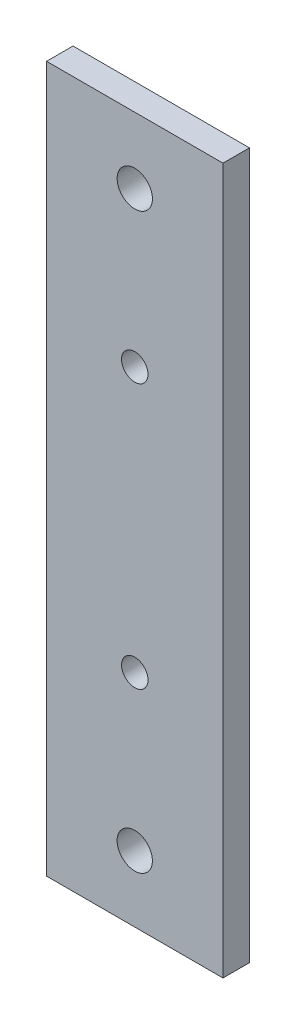
ISO-10303-21;
HEADER;
FILE_DESCRIPTION(('STEP AP214'),'2;1');
FILE_NAME('part.step','',(''),(''),'','','');
FILE_SCHEMA(('AUTOMOTIVE_DESIGN { 1 0 10303 214 1 1 1 1 }'));
ENDSEC;
DATA;
#1=APPLICATION_CONTEXT('core data for automotive mechanical design processes');
#2=APPLICATION_PROTOCOL_DEFINITION('international standard','automotive_design',2000,#1);
#3=PRODUCT_CONTEXT('',#1,'mechanical');
#4=PRODUCT('Part','Part','',(#3));
#5=PRODUCT_RELATED_PRODUCT_CATEGORY('part','',(#4));
#6=PRODUCT_DEFINITION_FORMATION('','',#4);
#7=PRODUCT_DEFINITION_CONTEXT('part definition',#1,'design');
#8=PRODUCT_DEFINITION('design','',#6,#7);
#9=PRODUCT_DEFINITION_SHAPE('','',#8);
#10=(LENGTH_UNIT() NAMED_UNIT(*) SI_UNIT(.MILLI.,.METRE.));
#11=(NAMED_UNIT(*) PLANE_ANGLE_UNIT() SI_UNIT($,.RADIAN.));
#12=(NAMED_UNIT(*) SI_UNIT($,.STERADIAN.) SOLID_ANGLE_UNIT());
#13=UNCERTAINTY_MEASURE_WITH_UNIT(LENGTH_MEASURE(1.E-05),#10,'distance_accuracy_value','');
#14=(GEOMETRIC_REPRESENTATION_CONTEXT(3) GLOBAL_UNCERTAINTY_ASSIGNED_CONTEXT((#13)) GLOBAL_UNIT_ASSIGNED_CONTEXT((#10,
#11,#12)) REPRESENTATION_CONTEXT('',''));
#15=CARTESIAN_POINT('',(0.,0.,0.));
#16=DIRECTION('',(0.,0.,1.));
#17=DIRECTION('',(1.,0.,0.));
#18=AXIS2_PLACEMENT_3D('',#15,#16,#17);
#19=CARTESIAN_POINT('',(0.,80.,3.));
#20=DIRECTION('',(0.,0.,-1.));
#21=DIRECTION('',(-1.,0.,0.));
#22=AXIS2_PLACEMENT_3D('',#19,#20,#21);
#23=PLANE('',#22);
#24=CARTESIAN_POINT('',(10.,72.5,3.));
#25=DIRECTION('',(0.,0.,1.));
#26=DIRECTION('',(1.,0.,0.));
#27=AXIS2_PLACEMENT_3D('',#24,#25,#26);
#28=CIRCLE('',#27,2.);
#29=CARTESIAN_POINT('',(12.,72.5,3.));
#30=VERTEX_POINT('',#29);
#31=EDGE_CURVE('E121',#30,#30,#28,.T.);
#32=ORIENTED_EDGE('',*,*,#31,.F.);
#33=EDGE_LOOP('',(#32));
#34=FACE_BOUND('',#33,.T.);
#35=CARTESIAN_POINT('',(10.,55.,3.));
#36=DIRECTION('',(0.,0.,1.));
#37=DIRECTION('',(1.,0.,0.));
#38=AXIS2_PLACEMENT_3D('',#35,#36,#37);
#39=CIRCLE('',#38,1.5);
#40=CARTESIAN_POINT('',(11.5,55.,3.));
#41=VERTEX_POINT('',#40);
#42=EDGE_CURVE('E100',#41,#41,#39,.T.);
#43=ORIENTED_EDGE('',*,*,#42,.F.);
#44=EDGE_LOOP('',(#43));
#45=FACE_BOUND('',#44,.T.);
#46=DIRECTION('',(0.,-1.,0.));
#47=VECTOR('',#46,1.);
#48=CARTESIAN_POINT('',(0.,0.,3.));
#49=LINE('',#48,#47);
#50=CARTESIAN_POINT('',(0.,80.,3.));
#51=VERTEX_POINT('',#50);
#52=CARTESIAN_POINT('',(0.,0.,3.));
#53=VERTEX_POINT('',#52);
#54=EDGE_CURVE('E85',#51,#53,#49,.T.);
#55=ORIENTED_EDGE('',*,*,#54,.T.);
#56=DIRECTION('',(1.,0.,0.));
#57=VECTOR('',#56,1.);
#58=CARTESIAN_POINT('',(0.,0.,3.));
#59=LINE('',#58,#57);
#60=CARTESIAN_POINT('',(20.,0.,3.));
#61=VERTEX_POINT('',#60);
#62=EDGE_CURVE('E80',#53,#61,#59,.T.);
#63=ORIENTED_EDGE('',*,*,#62,.T.);
#64=DIRECTION('',(0.,1.,0.));
#65=VECTOR('',#64,1.);
#66=CARTESIAN_POINT('',(20.,0.,3.));
#67=LINE('',#66,#65);
#68=CARTESIAN_POINT('',(20.,80.,3.));
#69=VERTEX_POINT('',#68);
#70=EDGE_CURVE('E83',#61,#69,#67,.T.);
#71=ORIENTED_EDGE('',*,*,#70,.T.);
#72=DIRECTION('',(-1.,0.,0.));
#73=VECTOR('',#72,1.);
#74=CARTESIAN_POINT('',(0.,80.,3.));
#75=LINE('',#74,#73);
#76=EDGE_CURVE('E50',#69,#51,#75,.T.);
#77=ORIENTED_EDGE('',*,*,#76,.T.);
#78=EDGE_LOOP('',(#55,#63,#71,#77));
#79=FACE_BOUND('',#78,.T.);
#80=CARTESIAN_POINT('',(10.,25.,3.));
#81=DIRECTION('',(0.,0.,1.));
#82=DIRECTION('',(-1.,0.,0.));
#83=AXIS2_PLACEMENT_3D('',#80,#81,#82);
#84=CIRCLE('',#83,1.5);
#85=CARTESIAN_POINT('',(8.5,25.,3.));
#86=VERTEX_POINT('',#85);
#87=EDGE_CURVE('E115',#86,#86,#84,.T.);
#88=ORIENTED_EDGE('',*,*,#87,.F.);
#89=EDGE_LOOP('',(#88));
#90=FACE_BOUND('',#89,.T.);
#91=CARTESIAN_POINT('',(10.,7.49999999999999,3.));
#92=DIRECTION('',(0.,0.,1.));
#93=DIRECTION('',(-1.,0.,0.));
#94=AXIS2_PLACEMENT_3D('',#91,#92,#93);
#95=CIRCLE('',#94,2.);
#96=CARTESIAN_POINT('',(8.,7.49999999999999,3.));
#97=VERTEX_POINT('',#96);
#98=EDGE_CURVE('E127',#97,#97,#95,.T.);
#99=ORIENTED_EDGE('',*,*,#98,.F.);
#100=EDGE_LOOP('',(#99));
#101=FACE_BOUND('',#100,.T.);
#102=ADVANCED_FACE('F33',(#34,#45,#79,#90,#101),#23,.F.);
#103=CARTESIAN_POINT('',(0.,80.,0.));
#104=DIRECTION('',(0.,0.,-1.));
#105=DIRECTION('',(-1.,0.,0.));
#106=AXIS2_PLACEMENT_3D('',#103,#104,#105);
#107=PLANE('',#106);
#108=CARTESIAN_POINT('',(10.,72.5,0.));
#109=DIRECTION('',(0.,0.,1.));
#110=DIRECTION('',(1.,0.,0.));
#111=AXIS2_PLACEMENT_3D('',#108,#109,#110);
#112=CIRCLE('',#111,2.);
#113=CARTESIAN_POINT('',(12.,72.5,0.));
#114=VERTEX_POINT('',#113);
#115=EDGE_CURVE('E124',#114,#114,#112,.T.);
#116=ORIENTED_EDGE('',*,*,#115,.T.);
#117=EDGE_LOOP('',(#116));
#118=FACE_BOUND('',#117,.T.);
#119=CARTESIAN_POINT('',(10.,55.,0.));
#120=DIRECTION('',(0.,0.,1.));
#121=DIRECTION('',(1.,0.,0.));
#122=AXIS2_PLACEMENT_3D('',#119,#120,#121);
#123=CIRCLE('',#122,1.5);
#124=CARTESIAN_POINT('',(11.5,55.,0.));
#125=VERTEX_POINT('',#124);
#126=EDGE_CURVE('E112',#125,#125,#123,.T.);
#127=ORIENTED_EDGE('',*,*,#126,.T.);
#128=EDGE_LOOP('',(#127));
#129=FACE_BOUND('',#128,.T.);
#130=DIRECTION('',(0.,-1.,0.));
#131=VECTOR('',#130,1.);
#132=CARTESIAN_POINT('',(0.,0.,0.));
#133=LINE('',#132,#131);
#134=CARTESIAN_POINT('',(0.,80.,0.));
#135=VERTEX_POINT('',#134);
#136=CARTESIAN_POINT('',(0.,0.,0.));
#137=VERTEX_POINT('',#136);
#138=EDGE_CURVE('E97',#135,#137,#133,.T.);
#139=ORIENTED_EDGE('',*,*,#138,.F.);
#140=DIRECTION('',(-1.,0.,0.));
#141=VECTOR('',#140,1.);
#142=CARTESIAN_POINT('',(0.,80.,0.));
#143=LINE('',#142,#141);
#144=CARTESIAN_POINT('',(20.,80.,0.));
#145=VERTEX_POINT('',#144);
#146=EDGE_CURVE('E73',#145,#135,#143,.T.);
#147=ORIENTED_EDGE('',*,*,#146,.F.);
#148=DIRECTION('',(0.,1.,0.));
#149=VECTOR('',#148,1.);
#150=CARTESIAN_POINT('',(20.,0.,0.));
#151=LINE('',#150,#149);
#152=CARTESIAN_POINT('',(20.,0.,0.));
#153=VERTEX_POINT('',#152);
#154=EDGE_CURVE('E67',#153,#145,#151,.T.);
#155=ORIENTED_EDGE('',*,*,#154,.F.);
#156=DIRECTION('',(1.,0.,0.));
#157=VECTOR('',#156,1.);
#158=CARTESIAN_POINT('',(0.,0.,0.));
#159=LINE('',#158,#157);
#160=EDGE_CURVE('E89',#137,#153,#159,.T.);
#161=ORIENTED_EDGE('',*,*,#160,.F.);
#162=EDGE_LOOP('',(#139,#147,#155,#161));
#163=FACE_BOUND('',#162,.T.);
#164=CARTESIAN_POINT('',(10.,25.,0.));
#165=DIRECTION('',(0.,0.,1.));
#166=DIRECTION('',(-1.,0.,0.));
#167=AXIS2_PLACEMENT_3D('',#164,#165,#166);
#168=CIRCLE('',#167,1.5);
#169=CARTESIAN_POINT('',(8.5,25.,0.));
#170=VERTEX_POINT('',#169);
#171=EDGE_CURVE('E118',#170,#170,#168,.T.);
#172=ORIENTED_EDGE('',*,*,#171,.T.);
#173=EDGE_LOOP('',(#172));
#174=FACE_BOUND('',#173,.T.);
#175=CARTESIAN_POINT('',(10.,7.49999999999999,0.));
#176=DIRECTION('',(0.,0.,1.));
#177=DIRECTION('',(-1.,0.,0.));
#178=AXIS2_PLACEMENT_3D('',#175,#176,#177);
#179=CIRCLE('',#178,2.);
#180=CARTESIAN_POINT('',(8.,7.49999999999999,0.));
#181=VERTEX_POINT('',#180);
#182=EDGE_CURVE('E130',#181,#181,#179,.T.);
#183=ORIENTED_EDGE('',*,*,#182,.T.);
#184=EDGE_LOOP('',(#183));
#185=FACE_BOUND('',#184,.T.);
#186=ADVANCED_FACE('F108',(#118,#129,#163,#174,#185),#107,.T.);
#187=CARTESIAN_POINT('',(0.,0.,3.));
#188=DIRECTION('',(1.,0.,0.));
#189=DIRECTION('',(0.,0.,-1.));
#190=AXIS2_PLACEMENT_3D('',#187,#188,#189);
#191=PLANE('',#190);
#192=ORIENTED_EDGE('',*,*,#138,.T.);
#193=DIRECTION('',(0.,0.,-1.));
#194=VECTOR('',#193,1.);
#195=CARTESIAN_POINT('',(0.,0.,3.));
#196=LINE('',#195,#194);
#197=EDGE_CURVE('E11',#53,#137,#196,.T.);
#198=ORIENTED_EDGE('',*,*,#197,.F.);
#199=ORIENTED_EDGE('',*,*,#54,.F.);
#200=DIRECTION('',(0.,0.,-1.));
#201=VECTOR('',#200,1.);
#202=CARTESIAN_POINT('',(0.,80.,3.));
#203=LINE('',#202,#201);
#204=EDGE_CURVE('E93',#51,#135,#203,.T.);
#205=ORIENTED_EDGE('',*,*,#204,.T.);
#206=EDGE_LOOP('',(#192,#198,#199,#205));
#207=FACE_BOUND('',#206,.T.);
#208=ADVANCED_FACE('F35',(#207),#191,.F.);
#209=CARTESIAN_POINT('',(0.,0.,3.));
#210=DIRECTION('',(0.,1.,0.));
#211=DIRECTION('',(0.,0.,1.));
#212=AXIS2_PLACEMENT_3D('',#209,#210,#211);
#213=PLANE('',#212);
#214=ORIENTED_EDGE('',*,*,#160,.T.);
#215=DIRECTION('',(0.,0.,-1.));
#216=VECTOR('',#215,1.);
#217=CARTESIAN_POINT('',(20.,0.,3.));
#218=LINE('',#217,#216);
#219=EDGE_CURVE('E42',#61,#153,#218,.T.);
#220=ORIENTED_EDGE('',*,*,#219,.F.);
#221=ORIENTED_EDGE('',*,*,#62,.F.);
#222=ORIENTED_EDGE('',*,*,#197,.T.);
#223=EDGE_LOOP('',(#214,#220,#221,#222));
#224=FACE_BOUND('',#223,.T.);
#225=ADVANCED_FACE('F88',(#224),#213,.F.);
#226=CARTESIAN_POINT('',(20.,0.,3.));
#227=DIRECTION('',(-1.,0.,0.));
#228=DIRECTION('',(0.,0.,1.));
#229=AXIS2_PLACEMENT_3D('',#226,#227,#228);
#230=PLANE('',#229);
#231=ORIENTED_EDGE('',*,*,#154,.T.);
#232=DIRECTION('',(0.,0.,-1.));
#233=VECTOR('',#232,1.);
#234=CARTESIAN_POINT('',(20.,80.,3.));
#235=LINE('',#234,#233);
#236=EDGE_CURVE('E90',#69,#145,#235,.T.);
#237=ORIENTED_EDGE('',*,*,#236,.F.);
#238=ORIENTED_EDGE('',*,*,#70,.F.);
#239=ORIENTED_EDGE('',*,*,#219,.T.);
#240=EDGE_LOOP('',(#231,#237,#238,#239));
#241=FACE_BOUND('',#240,.T.);
#242=ADVANCED_FACE('F91',(#241),#230,.F.);
#243=CARTESIAN_POINT('',(0.,80.,3.));
#244=DIRECTION('',(0.,-1.,0.));
#245=DIRECTION('',(0.,0.,-1.));
#246=AXIS2_PLACEMENT_3D('',#243,#244,#245);
#247=PLANE('',#246);
#248=ORIENTED_EDGE('',*,*,#146,.T.);
#249=ORIENTED_EDGE('',*,*,#204,.F.);
#250=ORIENTED_EDGE('',*,*,#76,.F.);
#251=ORIENTED_EDGE('',*,*,#236,.T.);
#252=EDGE_LOOP('',(#248,#249,#250,#251));
#253=FACE_BOUND('',#252,.T.);
#254=ADVANCED_FACE('F105',(#253),#247,.F.);
#255=CARTESIAN_POINT('',(10.,55.,3.));
#256=DIRECTION('',(0.,0.,-1.));
#257=DIRECTION('',(-1.,0.,0.));
#258=AXIS2_PLACEMENT_3D('',#255,#256,#257);
#259=CYLINDRICAL_SURFACE('',#258,1.5);
#260=ORIENTED_EDGE('',*,*,#42,.T.);
#261=EDGE_LOOP('',(#260));
#262=FACE_BOUND('',#261,.T.);
#263=ORIENTED_EDGE('',*,*,#126,.F.);
#264=EDGE_LOOP('',(#263));
#265=FACE_BOUND('',#264,.T.);
#266=ADVANCED_FACE('F150',(#262,#265),#259,.F.);
#267=CARTESIAN_POINT('',(10.,25.,3.));
#268=DIRECTION('',(0.,0.,-1.));
#269=DIRECTION('',(-1.,0.,0.));
#270=AXIS2_PLACEMENT_3D('',#267,#268,#269);
#271=CYLINDRICAL_SURFACE('',#270,1.5);
#272=ORIENTED_EDGE('',*,*,#87,.T.);
#273=EDGE_LOOP('',(#272));
#274=FACE_BOUND('',#273,.T.);
#275=ORIENTED_EDGE('',*,*,#171,.F.);
#276=EDGE_LOOP('',(#275));
#277=FACE_BOUND('',#276,.T.);
#278=ADVANCED_FACE('F196',(#274,#277),#271,.F.);
#279=CARTESIAN_POINT('',(10.,72.5,3.));
#280=DIRECTION('',(0.,0.,-1.));
#281=DIRECTION('',(-1.,0.,0.));
#282=AXIS2_PLACEMENT_3D('',#279,#280,#281);
#283=CYLINDRICAL_SURFACE('',#282,2.);
#284=ORIENTED_EDGE('',*,*,#31,.T.);
#285=EDGE_LOOP('',(#284));
#286=FACE_BOUND('',#285,.T.);
#287=ORIENTED_EDGE('',*,*,#115,.F.);
#288=EDGE_LOOP('',(#287));
#289=FACE_BOUND('',#288,.T.);
#290=ADVANCED_FACE('F204',(#286,#289),#283,.F.);
#291=CARTESIAN_POINT('',(10.,7.49999999999999,3.));
#292=DIRECTION('',(0.,0.,-1.));
#293=DIRECTION('',(-1.,0.,0.));
#294=AXIS2_PLACEMENT_3D('',#291,#292,#293);
#295=CYLINDRICAL_SURFACE('',#294,2.);
#296=ORIENTED_EDGE('',*,*,#98,.T.);
#297=EDGE_LOOP('',(#296));
#298=FACE_BOUND('',#297,.T.);
#299=ORIENTED_EDGE('',*,*,#182,.F.);
#300=EDGE_LOOP('',(#299));
#301=FACE_BOUND('',#300,.T.);
#302=ADVANCED_FACE('F136',(#298,#301),#295,.F.);
#303=CLOSED_SHELL('',(#102,#186,#208,#225,#242,#254,#266,#278,#290,#302));
#304=MANIFOLD_SOLID_BREP('B2',#303);
#305=ADVANCED_BREP_SHAPE_REPRESENTATION('',(#18,#304),#14);
#306=SHAPE_DEFINITION_REPRESENTATION(#9,#305);
ENDSEC;
END-ISO-10303-21;
